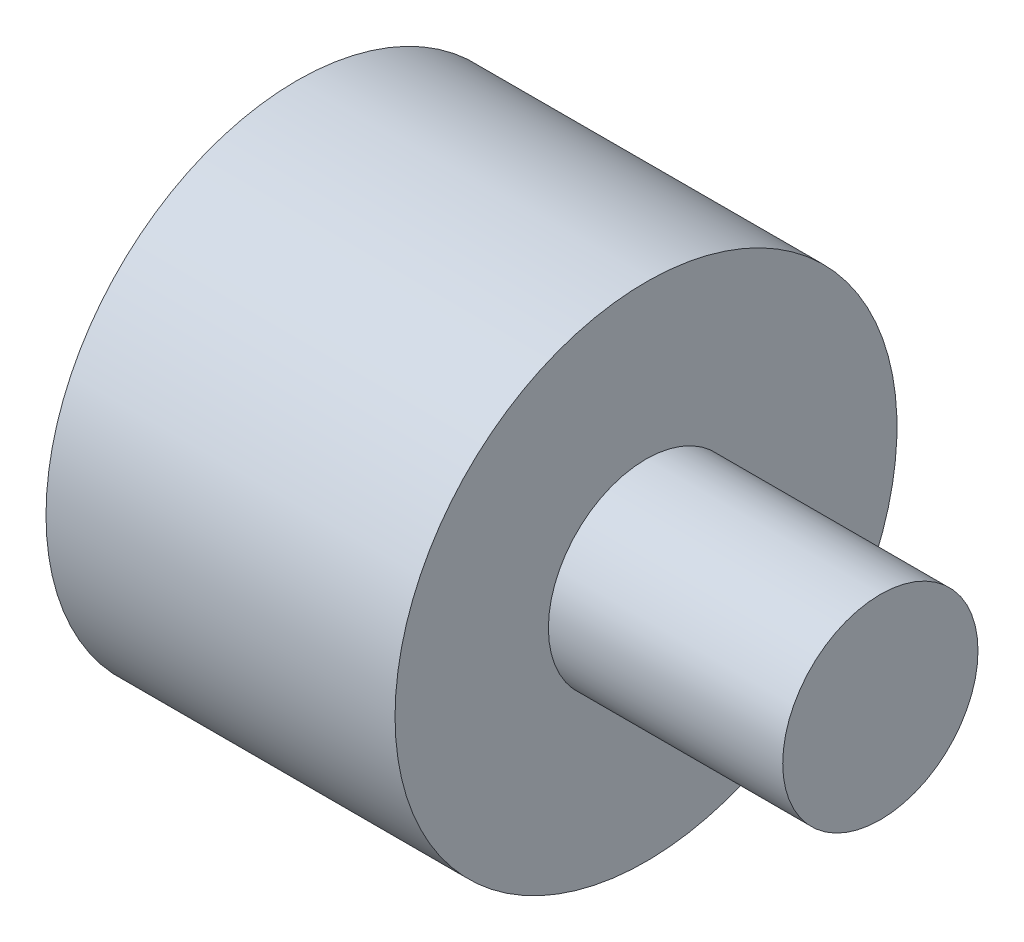
ISO-10303-21;
HEADER;
FILE_DESCRIPTION(('STEP AP214'),'2;1');
FILE_NAME('part.step','',(''),(''),'','','');
FILE_SCHEMA(('AUTOMOTIVE_DESIGN { 1 0 10303 214 1 1 1 1 }'));
ENDSEC;
DATA;
#1=APPLICATION_CONTEXT('core data for automotive mechanical design processes');
#2=APPLICATION_PROTOCOL_DEFINITION('international standard','automotive_design',2000,#1);
#3=PRODUCT_CONTEXT('',#1,'mechanical');
#4=PRODUCT('Part','Part','',(#3));
#5=PRODUCT_RELATED_PRODUCT_CATEGORY('part','',(#4));
#6=PRODUCT_DEFINITION_FORMATION('','',#4);
#7=PRODUCT_DEFINITION_CONTEXT('part definition',#1,'design');
#8=PRODUCT_DEFINITION('design','',#6,#7);
#9=PRODUCT_DEFINITION_SHAPE('','',#8);
#10=(LENGTH_UNIT() NAMED_UNIT(*) SI_UNIT(.MILLI.,.METRE.));
#11=(NAMED_UNIT(*) PLANE_ANGLE_UNIT() SI_UNIT($,.RADIAN.));
#12=(NAMED_UNIT(*) SI_UNIT($,.STERADIAN.) SOLID_ANGLE_UNIT());
#13=UNCERTAINTY_MEASURE_WITH_UNIT(LENGTH_MEASURE(1.E-05),#10,'distance_accuracy_value','');
#14=(GEOMETRIC_REPRESENTATION_CONTEXT(3) GLOBAL_UNCERTAINTY_ASSIGNED_CONTEXT((#13)) GLOBAL_UNIT_ASSIGNED_CONTEXT((#10,
#11,#12)) REPRESENTATION_CONTEXT('',''));
#15=CARTESIAN_POINT('',(0.,0.,0.));
#16=DIRECTION('',(0.,0.,1.));
#17=DIRECTION('',(1.,0.,0.));
#18=AXIS2_PLACEMENT_3D('',#15,#16,#17);
#19=CARTESIAN_POINT('',(14.9367133610763,25.5326317549915,-48.230964393979));
#20=DIRECTION('',(-1.,0.,0.));
#21=DIRECTION('',(0.,0.,1.));
#22=AXIS2_PLACEMENT_3D('',#19,#20,#21);
#23=CYLINDRICAL_SURFACE('',#22,2.5);
#24=CARTESIAN_POINT('',(14.9367133610763,25.5326317549915,-48.230964393979));
#25=DIRECTION('',(1.,0.,0.));
#26=DIRECTION('',(0.,0.,-1.));
#27=AXIS2_PLACEMENT_3D('',#24,#25,#26);
#28=CIRCLE('',#27,2.5);
#29=CARTESIAN_POINT('',(14.9367133610763,25.5326317549915,-50.730964393979));
#30=VERTEX_POINT('',#29);
#31=EDGE_CURVE('E10',#30,#30,#28,.T.);
#32=ORIENTED_EDGE('',*,*,#31,.F.);
#33=EDGE_LOOP('',(#32));
#34=FACE_BOUND('',#33,.T.);
#35=CARTESIAN_POINT('',(8.93671336107633,25.5326317549915,-48.230964393979));
#36=DIRECTION('',(-1.,0.,0.));
#37=DIRECTION('',(0.,0.,1.));
#38=AXIS2_PLACEMENT_3D('',#35,#36,#37);
#39=CIRCLE('',#38,2.5);
#40=CARTESIAN_POINT('',(8.93671336107633,25.5326317549915,-45.730964393979));
#41=VERTEX_POINT('',#40);
#42=EDGE_CURVE('E45',#41,#41,#39,.F.);
#43=ORIENTED_EDGE('',*,*,#42,.T.);
#44=EDGE_LOOP('',(#43));
#45=FACE_BOUND('',#44,.T.);
#46=ADVANCED_FACE('F39',(#34,#45),#23,.T.);
#47=CARTESIAN_POINT('',(14.9367133610763,25.5326317549915,-48.230964393979));
#48=DIRECTION('',(1.,0.,0.));
#49=DIRECTION('',(0.,0.,-1.));
#50=AXIS2_PLACEMENT_3D('',#47,#48,#49);
#51=PLANE('',#50);
#52=ORIENTED_EDGE('',*,*,#31,.T.);
#53=EDGE_LOOP('',(#52));
#54=FACE_BOUND('',#53,.T.);
#55=ADVANCED_FACE('F63',(#54),#51,.T.);
#56=CARTESIAN_POINT('',(0.,25.5326317549915,-48.230964393979));
#57=DIRECTION('',(1.,0.,0.));
#58=DIRECTION('',(0.,0.,-1.));
#59=AXIS2_PLACEMENT_3D('',#56,#57,#58);
#60=PLANE('',#59);
#61=CARTESIAN_POINT('',(0.,25.5326317549915,-48.230964393979));
#62=DIRECTION('',(1.,0.,0.));
#63=DIRECTION('',(0.,0.,-1.));
#64=AXIS2_PLACEMENT_3D('',#61,#62,#63);
#65=CIRCLE('',#64,6.42584695550592);
#66=CARTESIAN_POINT('',(0.,25.5326317549915,-54.6568113494849));
#67=VERTEX_POINT('',#66);
#68=EDGE_CURVE('E53',#67,#67,#65,.T.);
#69=ORIENTED_EDGE('',*,*,#68,.F.);
#70=EDGE_LOOP('',(#69));
#71=FACE_BOUND('',#70,.T.);
#72=ADVANCED_FACE('F61',(#71),#60,.F.);
#73=CARTESIAN_POINT('',(27.111753189497,25.5326317549915,-48.230964393979));
#74=DIRECTION('',(-1.,0.,0.));
#75=DIRECTION('',(0.,0.,1.));
#76=AXIS2_PLACEMENT_3D('',#73,#74,#75);
#77=CYLINDRICAL_SURFACE('',#76,6.42584695550592);
#78=CARTESIAN_POINT('',(8.93671336107633,25.5326317549915,-48.230964393979));
#79=DIRECTION('',(-1.,0.,0.));
#80=DIRECTION('',(0.,0.,1.));
#81=AXIS2_PLACEMENT_3D('',#78,#79,#80);
#82=CIRCLE('',#81,6.42584695550592);
#83=CARTESIAN_POINT('',(8.93671336107633,25.5326317549915,-41.8051174384731));
#84=VERTEX_POINT('',#83);
#85=EDGE_CURVE('E49',#84,#84,#82,.T.);
#86=ORIENTED_EDGE('',*,*,#85,.T.);
#87=EDGE_LOOP('',(#86));
#88=FACE_BOUND('',#87,.T.);
#89=ORIENTED_EDGE('',*,*,#68,.T.);
#90=EDGE_LOOP('',(#89));
#91=FACE_BOUND('',#90,.T.);
#92=ADVANCED_FACE('F59',(#88,#91),#77,.T.);
#93=CARTESIAN_POINT('',(8.93671336107633,-68.3222882870289,-53.230964393979));
#94=DIRECTION('',(-1.,0.,0.));
#95=DIRECTION('',(0.,0.,1.));
#96=AXIS2_PLACEMENT_3D('',#93,#94,#95);
#97=PLANE('',#96);
#98=ORIENTED_EDGE('',*,*,#42,.F.);
#99=EDGE_LOOP('',(#98));
#100=FACE_BOUND('',#99,.T.);
#101=ORIENTED_EDGE('',*,*,#85,.F.);
#102=EDGE_LOOP('',(#101));
#103=FACE_BOUND('',#102,.T.);
#104=ADVANCED_FACE('F70',(#100,#103),#97,.F.);
#105=CLOSED_SHELL('',(#46,#55,#72,#92,#104));
#106=MANIFOLD_SOLID_BREP('B2',#105);
#107=ADVANCED_BREP_SHAPE_REPRESENTATION('',(#18,#106),#14);
#108=SHAPE_DEFINITION_REPRESENTATION(#9,#107);
ENDSEC;
END-ISO-10303-21;
